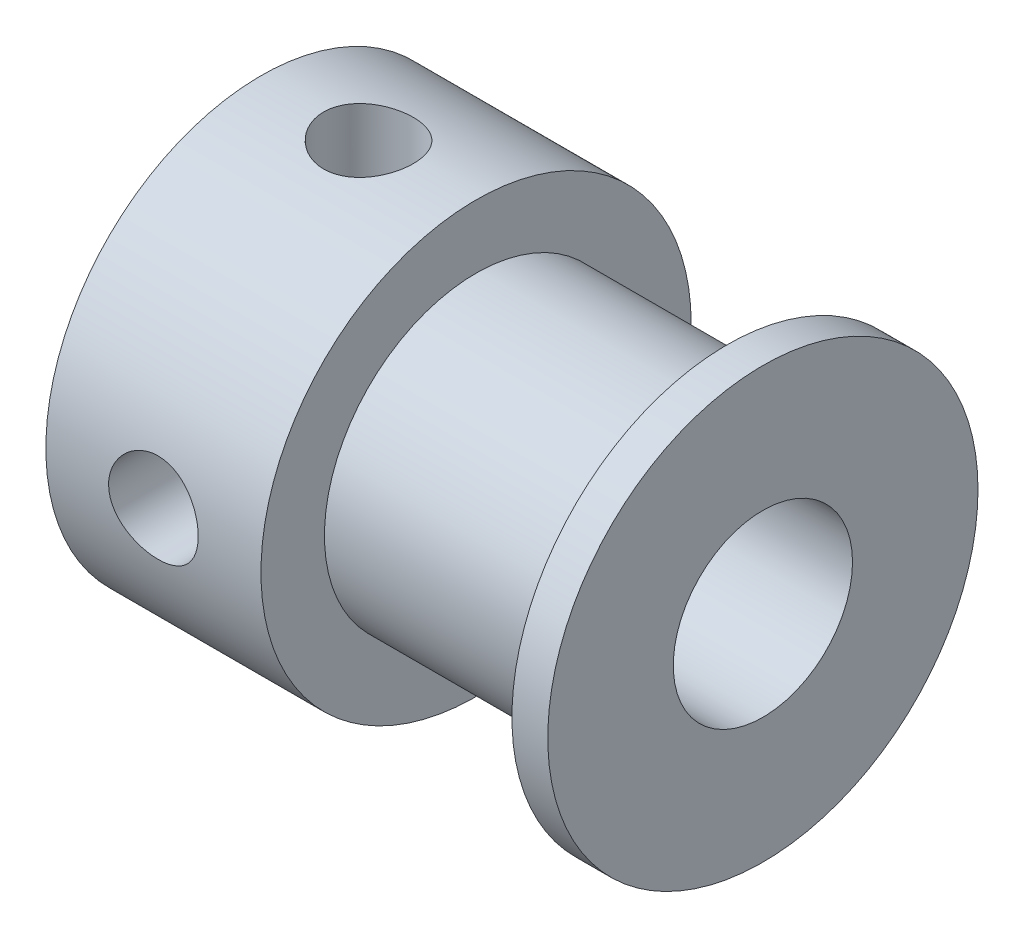
ISO-10303-21;
HEADER;
FILE_DESCRIPTION(('STEP AP214'),'2;1');
FILE_NAME('part.step','',(''),(''),'','','');
FILE_SCHEMA(('AUTOMOTIVE_DESIGN { 1 0 10303 214 1 1 1 1 }'));
ENDSEC;
DATA;
#1=APPLICATION_CONTEXT('core data for automotive mechanical design processes');
#2=APPLICATION_PROTOCOL_DEFINITION('international standard','automotive_design',2000,#1);
#3=PRODUCT_CONTEXT('',#1,'mechanical');
#4=PRODUCT('Part','Part','',(#3));
#5=PRODUCT_RELATED_PRODUCT_CATEGORY('part','',(#4));
#6=PRODUCT_DEFINITION_FORMATION('','',#4);
#7=PRODUCT_DEFINITION_CONTEXT('part definition',#1,'design');
#8=PRODUCT_DEFINITION('design','',#6,#7);
#9=PRODUCT_DEFINITION_SHAPE('','',#8);
#10=(LENGTH_UNIT() NAMED_UNIT(*) SI_UNIT(.MILLI.,.METRE.));
#11=(NAMED_UNIT(*) PLANE_ANGLE_UNIT() SI_UNIT($,.RADIAN.));
#12=(NAMED_UNIT(*) SI_UNIT($,.STERADIAN.) SOLID_ANGLE_UNIT());
#13=UNCERTAINTY_MEASURE_WITH_UNIT(LENGTH_MEASURE(1.E-05),#10,'distance_accuracy_value','');
#14=(GEOMETRIC_REPRESENTATION_CONTEXT(3) GLOBAL_UNCERTAINTY_ASSIGNED_CONTEXT((#13)) GLOBAL_UNIT_ASSIGNED_CONTEXT((#10,
#11,#12)) REPRESENTATION_CONTEXT('',''));
#15=CARTESIAN_POINT('',(0.,0.,0.));
#16=DIRECTION('',(0.,0.,1.));
#17=DIRECTION('',(1.,0.,0.));
#18=AXIS2_PLACEMENT_3D('',#15,#16,#17);
#19=CARTESIAN_POINT('',(0.,0.,0.));
#20=DIRECTION('',(1.,0.,0.));
#21=DIRECTION('',(0.,0.,-1.));
#22=AXIS2_PLACEMENT_3D('',#19,#20,#21);
#23=CYLINDRICAL_SURFACE('',#22,2.5);
#24=CARTESIAN_POINT('',(1.75000000000001,0.,2.5));
#25=CARTESIAN_POINT('',(1.75000412789938,0.0657149536912327,2.49999641755189));
#26=CARTESIAN_POINT('',(1.7552125914021,0.13150824962254,2.49738113774397));
#27=CARTESIAN_POINT('',(1.77581610042615,0.26115029408553,2.48717695046745));
#28=CARTESIAN_POINT('',(1.79123049124707,0.324995108391878,2.4795785978623));
#29=CARTESIAN_POINT('',(1.831492260771,0.448666931100716,2.4602034925414));
#30=CARTESIAN_POINT('',(1.85630298031002,0.508508503673972,2.448442989719));
#31=CARTESIAN_POINT('',(1.91446327670618,0.623090771008203,2.42182220644723));
#32=CARTESIAN_POINT('',(1.94781218031107,0.677831867487559,2.40696217041913));
#33=CARTESIAN_POINT('',(2.02439656185663,0.784384772202394,2.37445322822571));
#34=CARTESIAN_POINT('',(2.06810809904956,0.835819013902635,2.3566899890942));
#35=CARTESIAN_POINT('',(2.1631518490588,0.930974306083716,2.32074962808431));
#36=CARTESIAN_POINT('',(2.21448981471555,0.974689478883452,2.30257220261294));
#37=CARTESIAN_POINT('',(2.32810418690423,1.05656500056284,2.26623688996684));
#38=CARTESIAN_POINT('',(2.39092012293239,1.09403166943954,2.24818983712665));
#39=CARTESIAN_POINT('',(2.52295916998277,1.15771028361336,2.21607473465401));
#40=CARTESIAN_POINT('',(2.59217766090344,1.18393026870791,2.20200384508737));
#41=CARTESIAN_POINT('',(2.73083138177741,1.22266555273573,2.18072333797261));
#42=CARTESIAN_POINT('',(2.80000556508424,1.23590732135054,2.17315339479642));
#43=CARTESIAN_POINT('',(2.93997354722435,1.25053374163605,2.1647736243566));
#44=CARTESIAN_POINT('',(3.01076567608894,1.25193011046634,2.16395711679111));
#45=CARTESIAN_POINT('',(3.14285753039421,1.24335910896536,2.16888662821561));
#46=CARTESIAN_POINT('',(3.20428003902881,1.23473069942102,2.17385954577517));
#47=CARTESIAN_POINT('',(3.3246523867163,1.20867481132116,2.18845285917313));
#48=CARTESIAN_POINT('',(3.38360143163164,1.19124452987206,2.19807473539721));
#49=CARTESIAN_POINT('',(3.49903641570707,1.1477622254825,2.22109345515927));
#50=CARTESIAN_POINT('',(3.55543299848223,1.12151883389499,2.23457300829999));
#51=CARTESIAN_POINT('',(3.66329286573751,1.061302109585,2.26379255351755));
#52=CARTESIAN_POINT('',(3.71475391950011,1.02732530476558,2.27953355975239));
#53=CARTESIAN_POINT('',(3.81815156592903,0.94758256864098,2.31391447379108));
#54=CARTESIAN_POINT('',(3.86932109197019,0.900868072961596,2.33266887795933));
#55=CARTESIAN_POINT('',(3.96341927323862,0.799444473426712,2.36934529125509));
#56=CARTESIAN_POINT('',(4.00634399004235,0.744731570717852,2.38726689948501));
#57=CARTESIAN_POINT('',(4.08460707628715,0.625645632289807,2.42127484103705));
#58=CARTESIAN_POINT('',(4.11950059055717,0.560941989499257,2.43723730202509));
#59=CARTESIAN_POINT('',(4.17762128630375,0.425582769360993,2.46447351401553));
#60=CARTESIAN_POINT('',(4.20085773126895,0.354931970331593,2.47575098679441));
#61=CARTESIAN_POINT('',(4.23309425464584,0.215958114575875,2.49155417176795));
#62=CARTESIAN_POINT('',(4.24311404468347,0.147926913185404,2.4965617287664));
#63=CARTESIAN_POINT('',(4.2518309139181,0.0109744999366913,2.50091266823877));
#64=CARTESIAN_POINT('',(4.25053335704934,-0.057946274837377,2.5002587340164));
#65=CARTESIAN_POINT('',(4.23724163947655,-0.189041214982492,2.49363990316801));
#66=CARTESIAN_POINT('',(4.22608433408745,-0.251324260062442,2.48809057110237));
#67=CARTESIAN_POINT('',(4.19470241013114,-0.373008615377395,2.47277714143524));
#68=CARTESIAN_POINT('',(4.1744767919333,-0.432409607113745,2.46301257917916));
#69=CARTESIAN_POINT('',(4.12500191695853,-0.548610760562079,2.43980314267087));
#70=CARTESIAN_POINT('',(4.09551118735398,-0.605287996257689,2.42626102212424));
#71=CARTESIAN_POINT('',(4.02861558044244,-0.713076702123648,2.39679967896386));
#72=CARTESIAN_POINT('',(3.9912073317582,-0.764185787219099,2.38087944457232));
#73=CARTESIAN_POINT('',(3.9052994683339,-0.864709611613313,2.34635276671831));
#74=CARTESIAN_POINT('',(3.85607141443304,-0.913465097280795,2.32763606060552));
#75=CARTESIAN_POINT('',(3.75009356091336,-1.00232040139154,2.29077989504843));
#76=CARTESIAN_POINT('',(3.69333860147953,-1.04241423211355,2.27264084226908));
#77=CARTESIAN_POINT('',(3.57044543224961,-1.11463489312211,2.23813990282585));
#78=CARTESIAN_POINT('',(3.50398591723925,-1.14628186984829,2.2219066207934));
#79=CARTESIAN_POINT('',(3.36561241538434,-1.19760353251725,2.19467590460158));
#80=CARTESIAN_POINT('',(3.29370559187351,-1.21729364485946,2.18367172800773));
#81=CARTESIAN_POINT('',(3.15386222142319,-1.24232710931209,2.16951876260834));
#82=CARTESIAN_POINT('',(3.0862071832137,-1.24886624550107,2.16571729325614));
#83=CARTESIAN_POINT('',(2.95069116603659,-1.25086144297598,2.16456693307719));
#84=CARTESIAN_POINT('',(2.88283028907571,-1.24632230828049,2.16721524534441));
#85=CARTESIAN_POINT('',(2.75564562308498,-1.22740765699032,2.17797327562531));
#86=CARTESIAN_POINT('',(2.6961244123195,-1.21401039292849,2.18553868102992));
#87=CARTESIAN_POINT('',(2.58023985071912,-1.1789691977808,2.20463770234897));
#88=CARTESIAN_POINT('',(2.52387752238504,-1.15732261394975,2.21617259462095));
#89=CARTESIAN_POINT('',(2.41171893626674,-1.10476968162585,2.2428566295566));
#90=CARTESIAN_POINT('',(2.35621512271288,-1.07333892227057,2.25819652995239));
#91=CARTESIAN_POINT('',(2.25090682977427,-1.00268871454579,2.29044164543238));
#92=CARTESIAN_POINT('',(2.20110533685189,-0.963465214048303,2.30734767243153));
#93=CARTESIAN_POINT('',(2.10232252205298,-0.872754158330795,2.34327903949142));
#94=CARTESIAN_POINT('',(2.0541761220476,-0.820355528762707,2.36231229139336));
#95=CARTESIAN_POINT('',(1.96717127072046,-0.707693507775343,2.3984719031886));
#96=CARTESIAN_POINT('',(1.92831782571714,-0.647425904070975,2.4155972326005));
#97=CARTESIAN_POINT('',(1.86095454654725,-0.519914496024928,2.44622511981379));
#98=CARTESIAN_POINT('',(1.83251978823571,-0.452624379918263,2.45970120703636));
#99=CARTESIAN_POINT('',(1.78773979010132,-0.313427626617735,2.48126676704332));
#100=CARTESIAN_POINT('',(1.77136019146303,-0.241534749528953,2.48937154216165));
#101=CARTESIAN_POINT('',(1.7576282361552,-0.140752433104227,2.49619327387079));
#102=CARTESIAN_POINT('',(1.75477169892048,-0.112702349299371,2.49761706674002));
#103=CARTESIAN_POINT('',(1.750956668104,-0.0564396647589458,2.49952121222331));
#104=CARTESIAN_POINT('',(1.74999822691101,-0.0282270595592261,2.50000153879704));
#105=CARTESIAN_POINT('',(1.75000000000001,0.,2.5));
#106=B_SPLINE_CURVE_WITH_KNOTS('',3,(#24,#25,#26,#27,#28,#29,#30,#31,#32,#33,#34,#35,#36,#37,
#38,#39,#40,#41,#42,#43,#44,#45,#46,#47,#48,#49,#50,#51,#52,#53,#54,#55,#56,#57,#58,#59,#60,#61,
#62,#63,#64,#65,#66,#67,#68,#69,#70,#71,#72,#73,#74,#75,#76,#77,#78,#79,#80,#81,#82,#83,#84,#85,
#86,#87,#88,#89,#90,#91,#92,#93,#94,#95,#96,#97,#98,#99,#100,#101,#102,#103,#104,#105),
.UNSPECIFIED.,.T.,.F.,(4,2,2,2,2,2,2,2,2,2,2,2,2,2,2,2,2,2,2,2,2,2,2,2,2,2,2,2,2,2,2,2,2,2,2,2,
2,2,2,2,4),(0.,0.197030321775364,0.394435187136495,0.59107769436537,0.787704700726955,
0.996227198397605,1.20490779706754,1.4297715803844,1.6544743487285,1.86572515175286,
2.07676696661274,2.26257140511649,2.44843504907097,2.63862800210608,2.82890651575276,
3.04331176667346,3.25781918248356,3.48228777768049,3.70657771140347,3.9122911308918,
4.11790705639343,4.3075863313265,4.49728652038662,4.69241070034871,4.88761813435421,
5.10199513305521,5.31651985769287,5.54143352699589,5.76605639925969,5.96911634372963,
6.17208824825003,6.35572412805225,6.53941910979594,6.73545570969514,6.93159451423693,
7.15156553440619,7.37165479220712,7.59330017078652,7.81431135781158,7.89894100172117,
7.98357298143554),.UNSPECIFIED.);
#107=CARTESIAN_POINT('',(1.75000000000001,0.,2.5));
#108=VERTEX_POINT('',#107);
#109=EDGE_CURVE('E80',#108,#108,#106,.T.);
#110=ORIENTED_EDGE('',*,*,#109,.F.);
#111=EDGE_LOOP('',(#110));
#112=FACE_BOUND('',#111,.T.);
#113=CARTESIAN_POINT('',(3.,2.1650635094611,-1.25));
#114=CARTESIAN_POINT('',(3.06513476024406,2.16506918410574,-1.24999545384316));
#115=CARTESIAN_POINT('',(3.13035176440631,2.16804751484696,-1.24487496341652));
#116=CARTESIAN_POINT('',(3.25878408084644,2.17952958065066,-1.22465401237257));
#117=CARTESIAN_POINT('',(3.32199489380426,2.18804492569449,-1.20953258069272));
#118=CARTESIAN_POINT('',(3.44431458042993,2.20936683256748,-1.17012493587476));
#119=CARTESIAN_POINT('',(3.50344331559198,2.22215054341565,-1.14588744061716));
#120=CARTESIAN_POINT('',(3.6167802524959,2.25053331021072,-1.08908440672046));
#121=CARTESIAN_POINT('',(3.67098818782807,2.26613251845081,-1.05651841754472));
#122=CARTESIAN_POINT('',(3.77788216069688,2.29996086321802,-0.980833175663598));
#123=CARTESIAN_POINT('',(3.83007391959193,2.31830079547442,-0.937065045179713));
#124=CARTESIAN_POINT('',(3.92676048550839,2.35464978482132,-0.841567259518085));
#125=CARTESIAN_POINT('',(3.9712514532294,2.37265867289062,-0.789833657227866));
#126=CARTESIAN_POINT('',(4.05420893893458,2.40776846191186,-0.675611954268182));
#127=CARTESIAN_POINT('',(4.09206720982441,2.42472633022716,-0.612633986265718));
#128=CARTESIAN_POINT('',(4.1564260665572,2.45438445124411,-0.48019628324938));
#129=CARTESIAN_POINT('',(4.18293382017146,2.46708738979677,-0.410740672672694));
#130=CARTESIAN_POINT('',(4.22188082662637,2.48600576555297,-0.272556179907471));
#131=CARTESIAN_POINT('',(4.23518690794442,2.49261850276115,-0.204127238111022));
#132=CARTESIAN_POINT('',(4.2502076483438,2.50009479807584,-0.0657132858723104));
#133=CARTESIAN_POINT('',(4.25192932099464,2.50096183480737,0.00427075730467264));
#134=CARTESIAN_POINT('',(4.24406665753706,2.49703727395563,0.137290655529687));
#135=CARTESIAN_POINT('',(4.23545248059847,2.49273119865201,0.200401498970989));
#136=CARTESIAN_POINT('',(4.20889894511918,2.47967806574684,0.324142214897902));
#137=CARTESIAN_POINT('',(4.19095888877972,2.47093067582992,0.384771901367406));
#138=CARTESIAN_POINT('',(4.14614679238773,2.44964479109568,0.502886739461942));
#139=CARTESIAN_POINT('',(4.11915460853491,2.43705551911499,0.560316779393972));
#140=CARTESIAN_POINT('',(4.05717072974813,2.40922057483359,0.66997100189166));
#141=CARTESIAN_POINT('',(4.02217617087206,2.39397395196855,0.722193311048307));
#142=CARTESIAN_POINT('',(3.94138081058373,2.36055492999037,0.825217076122743));
#143=CARTESIAN_POINT('',(3.89487121459249,2.34224219997719,0.8754175937867));
#144=CARTESIAN_POINT('',(3.79426284383728,2.30567925733515,0.967630462872225));
#145=CARTESIAN_POINT('',(3.74015828465742,2.28742910332036,1.00963651446779));
#146=CARTESIAN_POINT('',(3.62168975946989,2.25180195115606,1.08688166830276));
#147=CARTESIAN_POINT('',(3.55689247118223,2.23455399988385,1.12152164372256));
#148=CARTESIAN_POINT('',(3.42132791080125,2.2046931284822,1.17914889125154));
#149=CARTESIAN_POINT('',(3.35056695872805,2.19207537557584,1.20214832276361));
#150=CARTESIAN_POINT('',(3.21098186089651,2.17430794771293,1.2339752637813));
#151=CARTESIAN_POINT('',(3.14244860119556,2.16864569810621,1.24378140264997));
#152=CARTESIAN_POINT('',(3.00449832310432,2.16397399202012,1.25189618326428));
#153=CARTESIAN_POINT('',(2.93508196360027,2.1649598361164,1.25021294664378));
#154=CARTESIAN_POINT('',(2.80543260177659,2.17292920675731,1.23629505417996));
#155=CARTESIAN_POINT('',(2.74502568611509,2.17924484383318,1.22523477089058));
#156=CARTESIAN_POINT('',(2.6270402671613,2.19617526939176,1.19462035579055));
#157=CARTESIAN_POINT('',(2.56946268656674,2.20679145006292,1.17506347327952));
#158=CARTESIAN_POINT('',(2.45573583637163,2.23170277599571,1.12705948575611));
#159=CARTESIAN_POINT('',(2.39977622893306,2.24614554053829,1.0982425796159));
#160=CARTESIAN_POINT('',(2.29316341057626,2.27695149371562,1.03285883001975));
#161=CARTESIAN_POINT('',(2.2425129456084,2.29331566693935,0.99628800541527));
#162=CARTESIAN_POINT('',(2.14127654059557,2.3285999807042,0.911046458998566));
#163=CARTESIAN_POINT('',(2.09150356160293,2.34758228942861,0.861431590393708));
#164=CARTESIAN_POINT('',(2.00073470250801,2.38417793722366,0.75425561924786));
#165=CARTESIAN_POINT('',(1.95974178721183,2.40179081259637,0.696691843319183));
#166=CARTESIAN_POINT('',(1.88678284256237,2.43426702113696,0.573169203198446));
#167=CARTESIAN_POINT('',(1.85508360223636,2.44904552090037,0.507028871967641));
#168=CARTESIAN_POINT('',(1.80357762017826,2.47354193699126,0.369402955801352));
#169=CARTESIAN_POINT('',(1.78376043579212,2.48326429595466,0.29792212674022));
#170=CARTESIAN_POINT('',(1.75828929478167,2.49584385227353,0.158724602913021));
#171=CARTESIAN_POINT('',(1.75150265515486,2.49924909885239,0.0912643048130715));
#172=CARTESIAN_POINT('',(1.748945918182,2.50052662968914,-0.0439074824390041));
#173=CARTESIAN_POINT('',(1.75317196434555,2.49840085083612,-0.111618875368858));
#174=CARTESIAN_POINT('',(1.77177050849453,2.48917461047403,-0.240672490396433));
#175=CARTESIAN_POINT('',(1.78545606157209,2.48241118334987,-0.302140397264079));
#176=CARTESIAN_POINT('',(1.82165874912871,2.46490117079279,-0.421807440229521));
#177=CARTESIAN_POINT('',(1.84417715011682,2.45415401415995,-0.480006106194385));
#178=CARTESIAN_POINT('',(1.89840881520747,2.4290741343515,-0.594279257806105));
#179=CARTESIAN_POINT('',(1.9304741540098,2.41460771498499,-0.650156428375057));
#180=CARTESIAN_POINT('',(2.00244741357381,2.38360166427283,-0.75596830226753));
#181=CARTESIAN_POINT('',(2.04235893639459,2.36706108197951,-0.805900259268633));
#182=CARTESIAN_POINT('',(2.13349642377838,2.33160762783285,-0.903642505196113));
#183=CARTESIAN_POINT('',(2.18545310934649,2.31262248764622,-0.950747105674089));
#184=CARTESIAN_POINT('',(2.29681340141221,2.27578845203566,-1.03582910924334));
#185=CARTESIAN_POINT('',(2.35622352608461,2.25794057202332,-1.07379843751257));
#186=CARTESIAN_POINT('',(2.48329580822619,2.22499506631145,-1.14053884973207));
#187=CARTESIAN_POINT('',(2.55115941391092,2.21000217820338,-1.16898133245117));
#188=CARTESIAN_POINT('',(2.69166550542472,2.1858269541044,-1.21359838688301));
#189=CARTESIAN_POINT('',(2.76429111114086,2.17662520184628,-1.22981398896918));
#190=CARTESIAN_POINT('',(2.864756694565,2.16911590752238,-1.24295875983052));
#191=CARTESIAN_POINT('',(2.89170986799735,2.1676016125644,-1.24559513120481));
#192=CARTESIAN_POINT('',(2.9457706008528,2.16557419859688,-1.24911675636245));
#193=CARTESIAN_POINT('',(2.97287817048234,2.16506114656387,-1.25000189299984));
#194=CARTESIAN_POINT('',(3.,2.1650635094611,-1.25));
#195=B_SPLINE_CURVE_WITH_KNOTS('',3,(#113,#114,#115,#116,#117,#118,#119,#120,#121,#122,#123,
#124,#125,#126,#127,#128,#129,#130,#131,#132,#133,#134,#135,#136,#137,#138,#139,#140,#141,#142,
#143,#144,#145,#146,#147,#148,#149,#150,#151,#152,#153,#154,#155,#156,#157,#158,#159,#160,#161,
#162,#163,#164,#165,#166,#167,#168,#169,#170,#171,#172,#173,#174,#175,#176,#177,#178,#179,#180,
#181,#182,#183,#184,#185,#186,#187,#188,#189,#190,#191,#192,#193,#194),.UNSPECIFIED.,.T.,.F.,(4,
2,2,2,2,2,2,2,2,2,2,2,2,2,2,2,2,2,2,2,2,2,2,2,2,2,2,2,2,2,2,2,2,2,2,2,2,2,2,2,4),(0.,
0.195290153243394,0.390991116031005,0.585660744898606,0.780340906806436,0.99107789062279,
1.20191963855464,1.42697365298454,1.65188533704864,1.86079356209919,2.0695752960755,
2.26020121855673,2.45084140646819,2.64411918413933,2.8374662418784,3.04908989321113,
3.26087560307398,3.4861105216181,3.71110967764631,3.91827863567764,4.12530116485466,
4.30967729280032,4.49411315545078,4.68709120507609,4.88016857775059,5.09758429475766,
5.31507331222752,5.53830226766207,5.76133474760964,5.96390337986858,6.16640108492464,
6.35555531089365,6.54473666890016,6.74200938399339,6.93937287625898,7.15637802312584,
7.37357428556442,7.59763436298256,7.8209391625345,7.90225168981636,7.98356965618175),.UNSPECIFIED.);
#196=CARTESIAN_POINT('',(3.,2.1650635094611,-1.25));
#197=VERTEX_POINT('',#196);
#198=EDGE_CURVE('E73',#197,#197,#195,.T.);
#199=ORIENTED_EDGE('',*,*,#198,.F.);
#200=EDGE_LOOP('',(#199));
#201=FACE_BOUND('',#200,.T.);
#202=CARTESIAN_POINT('',(14.,0.,0.));
#203=DIRECTION('',(1.,0.,0.));
#204=DIRECTION('',(0.,0.,-1.));
#205=AXIS2_PLACEMENT_3D('',#202,#203,#204);
#206=CIRCLE('',#205,2.5);
#207=CARTESIAN_POINT('',(14.,0.,-2.5));
#208=VERTEX_POINT('',#207);
#209=EDGE_CURVE('E79',#208,#208,#206,.T.);
#210=ORIENTED_EDGE('',*,*,#209,.T.);
#211=EDGE_LOOP('',(#210));
#212=FACE_BOUND('',#211,.T.);
#213=CARTESIAN_POINT('',(0.,0.,0.));
#214=DIRECTION('',(1.,0.,0.));
#215=DIRECTION('',(0.,0.,-1.));
#216=AXIS2_PLACEMENT_3D('',#213,#214,#215);
#217=CIRCLE('',#216,2.5);
#218=CARTESIAN_POINT('',(0.,0.,-2.5));
#219=VERTEX_POINT('',#218);
#220=EDGE_CURVE('E49',#219,#219,#217,.T.);
#221=ORIENTED_EDGE('',*,*,#220,.F.);
#222=EDGE_LOOP('',(#221));
#223=FACE_BOUND('',#222,.T.);
#224=ADVANCED_FACE('F34',(#112,#201,#212,#223),#23,.F.);
#225=CARTESIAN_POINT('',(0.,2.5,0.));
#226=DIRECTION('',(-1.,0.,0.));
#227=DIRECTION('',(0.,0.,1.));
#228=AXIS2_PLACEMENT_3D('',#225,#226,#227);
#229=PLANE('',#228);
#230=ORIENTED_EDGE('',*,*,#220,.T.);
#231=EDGE_LOOP('',(#230));
#232=FACE_BOUND('',#231,.T.);
#233=CARTESIAN_POINT('',(0.,0.,0.));
#234=DIRECTION('',(1.,0.,0.));
#235=DIRECTION('',(0.,0.,-1.));
#236=AXIS2_PLACEMENT_3D('',#233,#234,#235);
#237=CIRCLE('',#236,6.);
#238=CARTESIAN_POINT('',(0.,0.,-6.));
#239=VERTEX_POINT('',#238);
#240=EDGE_CURVE('E53',#239,#239,#237,.T.);
#241=ORIENTED_EDGE('',*,*,#240,.F.);
#242=EDGE_LOOP('',(#241));
#243=FACE_BOUND('',#242,.T.);
#244=ADVANCED_FACE('F104',(#232,#243),#229,.T.);
#245=CARTESIAN_POINT('',(0.,0.,0.));
#246=DIRECTION('',(1.,0.,0.));
#247=DIRECTION('',(0.,0.,-1.));
#248=AXIS2_PLACEMENT_3D('',#245,#246,#247);
#249=CYLINDRICAL_SURFACE('',#248,6.);
#250=CARTESIAN_POINT('',(1.75000000000001,0.,6.));
#251=CARTESIAN_POINT('',(1.75000247746923,-0.0694090417016603,5.99999871526651));
#252=CARTESIAN_POINT('',(1.75580066571876,-0.138848789520875,5.99878328775043));
#253=CARTESIAN_POINT('',(1.77881934953286,-0.275761316266992,5.99405200990679));
#254=CARTESIAN_POINT('',(1.79604852303694,-0.343232560128311,5.99053441189248));
#255=CARTESIAN_POINT('',(1.84137045492183,-0.474209132291339,5.98159109196202));
#256=CARTESIAN_POINT('',(1.86945239599889,-0.537718336709182,5.97616727052645));
#257=CARTESIAN_POINT('',(1.93564960885619,-0.659120328605954,5.96399927809859));
#258=CARTESIAN_POINT('',(1.97376443115584,-0.717013367534323,5.95725516625975));
#259=CARTESIAN_POINT('',(2.05953634019065,-0.826390324308832,5.9430770002465));
#260=CARTESIAN_POINT('',(2.10731200123509,-0.87778024416268,5.93563505848531));
#261=CARTESIAN_POINT('',(2.21079465919511,-0.971877776769387,5.92095657692448));
#262=CARTESIAN_POINT('',(2.26650231187227,-1.01458467096098,5.91372005416683));
#263=CARTESIAN_POINT('',(2.38495196876616,-1.09051031677216,5.90019442595308));
#264=CARTESIAN_POINT('',(2.44775838450275,-1.1236305468065,5.89391545174828));
#265=CARTESIAN_POINT('',(2.57819745177276,-1.17881119348063,5.8831284065002));
#266=CARTESIAN_POINT('',(2.64582958244254,-1.20087280167641,5.87862014467568));
#267=CARTESIAN_POINT('',(2.78298523741564,-1.23300240133736,5.87196500986123));
#268=CARTESIAN_POINT('',(2.85246835933477,-1.24323597696798,5.86978556855865));
#269=CARTESIAN_POINT('',(2.99219684286263,-1.25193357655614,5.86793690716491));
#270=CARTESIAN_POINT('',(3.0624421188653,-1.25039890894686,5.86826740800981));
#271=CARTESIAN_POINT('',(3.20048102797518,-1.23573719037196,5.87137174319175));
#272=CARTESIAN_POINT('',(3.26829597966121,-1.2228010523272,5.87410533679901));
#273=CARTESIAN_POINT('',(3.40077150964492,-1.18600543529945,5.88164437615942));
#274=CARTESIAN_POINT('',(3.46543192560633,-1.16214539481381,5.88644992841317));
#275=CARTESIAN_POINT('',(3.59030722841598,-1.10400003213928,5.89763191464102));
#276=CARTESIAN_POINT('',(3.65048629652707,-1.06964002534236,5.90401953785586));
#277=CARTESIAN_POINT('',(3.76429574426816,-0.991522699274812,5.91763890010721));
#278=CARTESIAN_POINT('',(3.81792530883597,-0.947764212262582,5.92487074398537));
#279=CARTESIAN_POINT('',(3.91821396108037,-0.851074921546778,5.93953730929909));
#280=CARTESIAN_POINT('',(3.96471616889701,-0.797981433412078,5.94697323199473));
#281=CARTESIAN_POINT('',(4.04818044222897,-0.684667288611794,5.96108088143001));
#282=CARTESIAN_POINT('',(4.08514236459839,-0.624446525025762,5.96775259670236));
#283=CARTESIAN_POINT('',(4.14851008153595,-0.498405541235476,5.97959870942815));
#284=CARTESIAN_POINT('',(4.17489680456711,-0.432575461926497,5.98477039710258));
#285=CARTESIAN_POINT('',(4.21619170483549,-0.297284620972153,5.99301338211281));
#286=CARTESIAN_POINT('',(4.23110139323139,-0.227824338595088,5.99608495596053));
#287=CARTESIAN_POINT('',(4.24879425206788,-0.0885918657008341,5.99974275215455));
#288=CARTESIAN_POINT('',(4.25179194149424,-0.018848055526178,6.00037293537579));
#289=CARTESIAN_POINT('',(4.24615505003089,0.120143798757714,5.99919952252774));
#290=CARTESIAN_POINT('',(4.2375211813984,0.189391872962257,5.99739607548153));
#291=CARTESIAN_POINT('',(4.20904434653046,0.324726367119812,5.99158564979184));
#292=CARTESIAN_POINT('',(4.18931251461653,0.390837192894204,5.98760052868077));
#293=CARTESIAN_POINT('',(4.13932213957859,0.518811446661329,5.97787227242395));
#294=CARTESIAN_POINT('',(4.10906275913401,0.580674536336772,5.97212899744579));
#295=CARTESIAN_POINT('',(4.03841962176243,0.699294306943491,5.95941241490714));
#296=CARTESIAN_POINT('',(3.99790807043093,0.755973219469831,5.9524239381233));
#297=CARTESIAN_POINT('',(3.90808043692372,0.861805445886516,5.93802568299709));
#298=CARTESIAN_POINT('',(3.85876332448105,0.910957877913282,5.93061585542511));
#299=CARTESIAN_POINT('',(3.7517444230003,1.0011786486518,5.91606024531377));
#300=CARTESIAN_POINT('',(3.69391696804471,1.04209914600204,5.90892089307501));
#301=CARTESIAN_POINT('',(3.57208371578621,1.11364719079243,5.89585601015805));
#302=CARTESIAN_POINT('',(3.50807817586089,1.14427516677863,5.88993042894651));
#303=CARTESIAN_POINT('',(3.37603880370177,1.19417246443921,5.88001700708041));
#304=CARTESIAN_POINT('',(3.30802896283416,1.21350309828031,5.87601872784687));
#305=CARTESIAN_POINT('',(3.16963344950774,1.24044038523407,5.87039184709697));
#306=CARTESIAN_POINT('',(3.09924811838056,1.2480487154444,5.86876290660367));
#307=CARTESIAN_POINT('',(2.95958659900035,1.25125926487611,5.86807907308506));
#308=CARTESIAN_POINT('',(2.89031592977795,1.24709542622725,5.86897402321502));
#309=CARTESIAN_POINT('',(2.75348599107978,1.22739905314031,5.87312447254928));
#310=CARTESIAN_POINT('',(2.6859267051839,1.21186662782265,5.87637994909626));
#311=CARTESIAN_POINT('',(2.55460222810934,1.16998217768584,5.88486132447716));
#312=CARTESIAN_POINT('',(2.49082675351308,1.14366117568421,5.8900815700793));
#313=CARTESIAN_POINT('',(2.36856122397334,1.08097457299757,5.90190705738738));
#314=CARTESIAN_POINT('',(2.31007166036688,1.04460803983029,5.9085124276546));
#315=CARTESIAN_POINT('',(2.19887837292056,0.962073695342405,5.92251579551146));
#316=CARTESIAN_POINT('',(2.14630087543502,0.915737890418221,5.92992613868404));
#317=CARTESIAN_POINT('',(2.04959050677365,0.81492443811533,5.94461839583213));
#318=CARTESIAN_POINT('',(2.00545958244852,0.760444918832964,5.9519002798488));
#319=CARTESIAN_POINT('',(1.92641142681595,0.644134427507699,5.96561444547637));
#320=CARTESIAN_POINT('',(1.89160632011372,0.582225921521345,5.97203596073244));
#321=CARTESIAN_POINT('',(1.83294977156998,0.453319843998451,5.98319908494092));
#322=CARTESIAN_POINT('',(1.80908875281813,0.386326781907242,5.98794216182101));
#323=CARTESIAN_POINT('',(1.77745972171158,0.266015292900104,5.99432499781443));
#324=CARTESIAN_POINT('',(1.76718123679115,0.213367593727928,5.99644035661395));
#325=CARTESIAN_POINT('',(1.75345054572268,0.107152674176536,5.99927832789758));
#326=CARTESIAN_POINT('',(1.74999808733281,0.0535854878488716,6.00000099184586));
#327=CARTESIAN_POINT('',(1.75000000000001,0.,6.));
#328=B_SPLINE_CURVE_WITH_KNOTS('',3,(#250,#251,#252,#253,#254,#255,#256,#257,#258,#259,#260,
#261,#262,#263,#264,#265,#266,#267,#268,#269,#270,#271,#272,#273,#274,#275,#276,#277,#278,#279,
#280,#281,#282,#283,#284,#285,#286,#287,#288,#289,#290,#291,#292,#293,#294,#295,#296,#297,#298,
#299,#300,#301,#302,#303,#304,#305,#306,#307,#308,#309,#310,#311,#312,#313,#314,#315,#316,#317,
#318,#319,#320,#321,#322,#323,#324,#325,#326,#327),.UNSPECIFIED.,.T.,.F.,(4,2,2,2,2,2,2,2,2,2,2,
2,2,2,2,2,2,2,2,2,2,2,2,2,2,2,2,2,2,2,2,2,2,2,2,2,2,2,4),(0.,0.208031045103182,
0.416220199906223,0.624202378825439,0.832175241572985,1.04287526388122,1.25359271551785,
1.46640449178548,1.67919333285489,1.88896575169853,2.09871484767163,2.30501712129058,
2.51133000030278,2.71914592416748,2.92698768368033,3.13889526355464,3.35080602278216,
3.56309724499661,3.77536051045769,3.98378339407673,4.19219351552275,4.39855286632619,
4.60492863390931,4.81401583995734,5.02312752564571,5.23571263829333,5.44828889851306,
5.65970050095022,5.87108185414182,6.07829223291035,6.28550062281358,6.49211731393252,
6.69875319081476,6.90919024830305,7.11967575117366,7.33258864398252,7.54531486464969,
7.70592588477276,7.86653096973387),.UNSPECIFIED.);
#329=CARTESIAN_POINT('',(1.75000000000001,0.,6.));
#330=VERTEX_POINT('',#329);
#331=EDGE_CURVE('E10',#330,#330,#328,.T.);
#332=ORIENTED_EDGE('',*,*,#331,.F.);
#333=EDGE_LOOP('',(#332));
#334=FACE_BOUND('',#333,.T.);
#335=CARTESIAN_POINT('',(4.25,6.,0.));
#336=CARTESIAN_POINT('',(4.24999752253078,5.99999871526651,-0.0694090417016606));
#337=CARTESIAN_POINT('',(4.24419933428125,5.99878328775043,-0.138848789520875));
#338=CARTESIAN_POINT('',(4.22118065046715,5.99405200990679,-0.275761316266993));
#339=CARTESIAN_POINT('',(4.20395147696307,5.99053441189248,-0.343232560128312));
#340=CARTESIAN_POINT('',(4.15862954507818,5.98159109196202,-0.474209132291342));
#341=CARTESIAN_POINT('',(4.13054760400111,5.97616727052645,-0.537718336709185));
#342=CARTESIAN_POINT('',(4.06435039114382,5.96399927809859,-0.659120328605958));
#343=CARTESIAN_POINT('',(4.02623556884417,5.95725516625975,-0.717013367534327));
#344=CARTESIAN_POINT('',(3.94046365980936,5.9430770002465,-0.826390324308836));
#345=CARTESIAN_POINT('',(3.89268799876492,5.93563505848531,-0.877780244162685));
#346=CARTESIAN_POINT('',(3.78920534080489,5.92095657692448,-0.971877776769392));
#347=CARTESIAN_POINT('',(3.73349768812774,5.91372005416683,-1.01458467096099));
#348=CARTESIAN_POINT('',(3.61504803123384,5.90019442595308,-1.09051031677217));
#349=CARTESIAN_POINT('',(3.55224161549726,5.89391545174828,-1.12363054680651));
#350=CARTESIAN_POINT('',(3.42180254822724,5.8831284065002,-1.17881119348064));
#351=CARTESIAN_POINT('',(3.35417041755746,5.87862014467568,-1.20087280167641));
#352=CARTESIAN_POINT('',(3.21701476258436,5.87196500986122,-1.23300240133737));
#353=CARTESIAN_POINT('',(3.14753164066523,5.86978556855865,-1.24323597696799));
#354=CARTESIAN_POINT('',(3.00780315713737,5.86793690716491,-1.25193357655615));
#355=CARTESIAN_POINT('',(2.9375578811347,5.86826740800981,-1.25039890894687));
#356=CARTESIAN_POINT('',(2.79951897202482,5.87137174319175,-1.23573719037197));
#357=CARTESIAN_POINT('',(2.73170402033879,5.87410533679901,-1.2228010523272));
#358=CARTESIAN_POINT('',(2.59922849035507,5.88164437615942,-1.18600543529945));
#359=CARTESIAN_POINT('',(2.53456807439367,5.88644992841317,-1.16214539481382));
#360=CARTESIAN_POINT('',(2.40969277158402,5.89763191464102,-1.10400003213928));
#361=CARTESIAN_POINT('',(2.34951370347293,5.90401953785586,-1.06964002534237));
#362=CARTESIAN_POINT('',(2.23570425573184,5.91763890010721,-0.991522699274817));
#363=CARTESIAN_POINT('',(2.18207469116402,5.92487074398537,-0.947764212262587));
#364=CARTESIAN_POINT('',(2.08178603891963,5.93953730929909,-0.851074921546782));
#365=CARTESIAN_POINT('',(2.03528383110299,5.94697323199473,-0.797981433412082));
#366=CARTESIAN_POINT('',(1.95181955777103,5.96108088143001,-0.684667288611798));
#367=CARTESIAN_POINT('',(1.9148576354016,5.96775259670236,-0.624446525025765));
#368=CARTESIAN_POINT('',(1.85148991846405,5.97959870942815,-0.498405541235478));
#369=CARTESIAN_POINT('',(1.82510319543288,5.98477039710258,-0.432575461926499));
#370=CARTESIAN_POINT('',(1.78380829516451,5.99301338211281,-0.297284620972155));
#371=CARTESIAN_POINT('',(1.7688986067686,5.99608495596053,-0.227824338595089));
#372=CARTESIAN_POINT('',(1.75120574793212,5.99974275215455,-0.0885918657008347));
#373=CARTESIAN_POINT('',(1.74820805850575,6.00037293537579,-0.0188480555261782));
#374=CARTESIAN_POINT('',(1.7538449499691,5.99919952252774,0.120143798757715));
#375=CARTESIAN_POINT('',(1.7624788186016,5.99739607548153,0.189391872962258));
#376=CARTESIAN_POINT('',(1.79095565346953,5.99158564979184,0.324726367119814));
#377=CARTESIAN_POINT('',(1.81068748538347,5.98760052868077,0.390837192894206));
#378=CARTESIAN_POINT('',(1.86067786042141,5.97787227242395,0.518811446661331));
#379=CARTESIAN_POINT('',(1.89093724086598,5.97212899744579,0.580674536336775));
#380=CARTESIAN_POINT('',(1.96158037823756,5.95941241490714,0.699294306943494));
#381=CARTESIAN_POINT('',(2.00209192956906,5.9524239381233,0.755973219469834));
#382=CARTESIAN_POINT('',(2.09191956307627,5.93802568299709,0.86180544588652));
#383=CARTESIAN_POINT('',(2.14123667551894,5.93061585542511,0.910957877913286));
#384=CARTESIAN_POINT('',(2.2482555769997,5.91606024531377,1.0011786486518));
#385=CARTESIAN_POINT('',(2.30608303195528,5.90892089307501,1.04209914600204));
#386=CARTESIAN_POINT('',(2.42791628421379,5.89585601015805,1.11364719079243));
#387=CARTESIAN_POINT('',(2.49192182413911,5.88993042894651,1.14427516677864));
#388=CARTESIAN_POINT('',(2.62396119629823,5.88001700708041,1.19417246443922));
#389=CARTESIAN_POINT('',(2.69197103716584,5.87601872784687,1.21350309828032));
#390=CARTESIAN_POINT('',(2.83036655049226,5.87039184709697,1.24044038523407));
#391=CARTESIAN_POINT('',(2.90075188161944,5.86876290660367,1.24804871544441));
#392=CARTESIAN_POINT('',(3.04041340099965,5.86807907308506,1.25125926487611));
#393=CARTESIAN_POINT('',(3.10968407022205,5.86897402321502,1.24709542622725));
#394=CARTESIAN_POINT('',(3.24651400892022,5.87312447254927,1.22739905314032));
#395=CARTESIAN_POINT('',(3.31407329481611,5.87637994909626,1.21186662782266));
#396=CARTESIAN_POINT('',(3.44539777189066,5.88486132447716,1.16998217768585));
#397=CARTESIAN_POINT('',(3.50917324648693,5.8900815700793,1.14366117568421));
#398=CARTESIAN_POINT('',(3.63143877602667,5.90190705738738,1.08097457299757));
#399=CARTESIAN_POINT('',(3.68992833963313,5.9085124276546,1.0446080398303));
#400=CARTESIAN_POINT('',(3.80112162707945,5.92251579551146,0.96207369534241));
#401=CARTESIAN_POINT('',(3.85369912456498,5.92992613868404,0.915737890418225));
#402=CARTESIAN_POINT('',(3.95040949322636,5.94461839583213,0.814924438115334));
#403=CARTESIAN_POINT('',(3.99454041755149,5.9519002798488,0.760444918832967));
#404=CARTESIAN_POINT('',(4.07358857318406,5.96561444547637,0.644134427507703));
#405=CARTESIAN_POINT('',(4.10839367988629,5.97203596073244,0.582225921521348));
#406=CARTESIAN_POINT('',(4.16705022843002,5.98319908494092,0.453319843998453));
#407=CARTESIAN_POINT('',(4.19091124718187,5.98794216182101,0.386326781907243));
#408=CARTESIAN_POINT('',(4.22254027828842,5.99432499781443,0.266015292900104));
#409=CARTESIAN_POINT('',(4.23281876320886,5.99644035661395,0.213367593727928));
#410=CARTESIAN_POINT('',(4.24654945427733,5.99927832789758,0.107152674176537));
#411=CARTESIAN_POINT('',(4.25000191266719,6.00000099184586,0.0535854878488716));
#412=CARTESIAN_POINT('',(4.25,6.,0.));
#413=B_SPLINE_CURVE_WITH_KNOTS('',3,(#335,#336,#337,#338,#339,#340,#341,#342,#343,#344,#345,
#346,#347,#348,#349,#350,#351,#352,#353,#354,#355,#356,#357,#358,#359,#360,#361,#362,#363,#364,
#365,#366,#367,#368,#369,#370,#371,#372,#373,#374,#375,#376,#377,#378,#379,#380,#381,#382,#383,
#384,#385,#386,#387,#388,#389,#390,#391,#392,#393,#394,#395,#396,#397,#398,#399,#400,#401,#402,
#403,#404,#405,#406,#407,#408,#409,#410,#411,#412),.UNSPECIFIED.,.T.,.F.,(4,2,2,2,2,2,2,2,2,2,2,
2,2,2,2,2,2,2,2,2,2,2,2,2,2,2,2,2,2,2,2,2,2,2,2,2,2,2,4),(0.,0.208031045103183,
0.416220199906225,0.624202378825443,0.832175241572989,1.04287526388123,1.25359271551786,
1.46640449178548,1.6791933328549,1.88896575169854,2.09871484767164,2.30501712129059,
2.5113300003028,2.71914592416749,2.92698768368034,3.13889526355466,3.35080602278218,
3.56309724499662,3.77536051045771,3.98378339407675,4.19219351552277,4.39855286632621,
4.60492863390933,4.81401583995737,5.02312752564574,5.23571263829336,5.44828889851309,
5.65970050095025,5.87108185414185,6.07829223291038,6.28550062281361,6.49211731393255,
6.6987531908148,6.90919024830309,7.11967575117369,7.33258864398256,7.54531486464973,
7.7059258847728,7.86653096973391),.UNSPECIFIED.);
#414=CARTESIAN_POINT('',(4.25,6.,0.));
#415=VERTEX_POINT('',#414);
#416=EDGE_CURVE('E45',#415,#415,#413,.T.);
#417=ORIENTED_EDGE('',*,*,#416,.F.);
#418=EDGE_LOOP('',(#417));
#419=FACE_BOUND('',#418,.T.);
#420=ORIENTED_EDGE('',*,*,#240,.T.);
#421=EDGE_LOOP('',(#420));
#422=FACE_BOUND('',#421,.T.);
#423=CARTESIAN_POINT('',(6.,0.,0.));
#424=DIRECTION('',(1.,0.,0.));
#425=DIRECTION('',(0.,0.,-1.));
#426=AXIS2_PLACEMENT_3D('',#423,#424,#425);
#427=CIRCLE('',#426,6.);
#428=CARTESIAN_POINT('',(6.,0.,-6.));
#429=VERTEX_POINT('',#428);
#430=EDGE_CURVE('E97',#429,#429,#427,.T.);
#431=ORIENTED_EDGE('',*,*,#430,.F.);
#432=EDGE_LOOP('',(#431));
#433=FACE_BOUND('',#432,.T.);
#434=ADVANCED_FACE('F59',(#334,#419,#422,#433),#249,.T.);
#435=CARTESIAN_POINT('',(6.,6.,0.));
#436=DIRECTION('',(1.,0.,0.));
#437=DIRECTION('',(0.,0.,-1.));
#438=AXIS2_PLACEMENT_3D('',#435,#436,#437);
#439=PLANE('',#438);
#440=ORIENTED_EDGE('',*,*,#430,.T.);
#441=EDGE_LOOP('',(#440));
#442=FACE_BOUND('',#441,.T.);
#443=CARTESIAN_POINT('',(6.,0.,0.));
#444=DIRECTION('',(1.,0.,0.));
#445=DIRECTION('',(0.,0.,-1.));
#446=AXIS2_PLACEMENT_3D('',#443,#444,#445);
#447=CIRCLE('',#446,4.2291);
#448=CARTESIAN_POINT('',(6.,0.,-4.2291));
#449=VERTEX_POINT('',#448);
#450=EDGE_CURVE('E94',#449,#449,#447,.T.);
#451=ORIENTED_EDGE('',*,*,#450,.F.);
#452=EDGE_LOOP('',(#451));
#453=FACE_BOUND('',#452,.T.);
#454=ADVANCED_FACE('F111',(#442,#453),#439,.T.);
#455=CARTESIAN_POINT('',(0.,0.,0.));
#456=DIRECTION('',(1.,0.,0.));
#457=DIRECTION('',(0.,0.,-1.));
#458=AXIS2_PLACEMENT_3D('',#455,#456,#457);
#459=CYLINDRICAL_SURFACE('',#458,4.2291);
#460=ORIENTED_EDGE('',*,*,#450,.T.);
#461=EDGE_LOOP('',(#460));
#462=FACE_BOUND('',#461,.T.);
#463=CARTESIAN_POINT('',(13.,0.,0.));
#464=DIRECTION('',(1.,0.,0.));
#465=DIRECTION('',(0.,0.,-1.));
#466=AXIS2_PLACEMENT_3D('',#463,#464,#465);
#467=CIRCLE('',#466,4.2291);
#468=CARTESIAN_POINT('',(13.,0.,-4.2291));
#469=VERTEX_POINT('',#468);
#470=EDGE_CURVE('E91',#469,#469,#467,.T.);
#471=ORIENTED_EDGE('',*,*,#470,.F.);
#472=EDGE_LOOP('',(#471));
#473=FACE_BOUND('',#472,.T.);
#474=ADVANCED_FACE('F138',(#462,#473),#459,.T.);
#475=CARTESIAN_POINT('',(13.,4.2291,0.));
#476=DIRECTION('',(-1.,0.,0.));
#477=DIRECTION('',(0.,0.,1.));
#478=AXIS2_PLACEMENT_3D('',#475,#476,#477);
#479=PLANE('',#478);
#480=ORIENTED_EDGE('',*,*,#470,.T.);
#481=EDGE_LOOP('',(#480));
#482=FACE_BOUND('',#481,.T.);
#483=CARTESIAN_POINT('',(13.,0.,0.));
#484=DIRECTION('',(1.,0.,0.));
#485=DIRECTION('',(0.,0.,-1.));
#486=AXIS2_PLACEMENT_3D('',#483,#484,#485);
#487=CIRCLE('',#486,6.);
#488=CARTESIAN_POINT('',(13.,0.,-6.));
#489=VERTEX_POINT('',#488);
#490=EDGE_CURVE('E88',#489,#489,#487,.T.);
#491=ORIENTED_EDGE('',*,*,#490,.F.);
#492=EDGE_LOOP('',(#491));
#493=FACE_BOUND('',#492,.T.);
#494=ADVANCED_FACE('F131',(#482,#493),#479,.T.);
#495=CARTESIAN_POINT('',(0.,0.,0.));
#496=DIRECTION('',(1.,0.,0.));
#497=DIRECTION('',(0.,0.,-1.));
#498=AXIS2_PLACEMENT_3D('',#495,#496,#497);
#499=CYLINDRICAL_SURFACE('',#498,6.);
#500=ORIENTED_EDGE('',*,*,#490,.T.);
#501=EDGE_LOOP('',(#500));
#502=FACE_BOUND('',#501,.T.);
#503=CARTESIAN_POINT('',(14.,0.,0.));
#504=DIRECTION('',(1.,0.,0.));
#505=DIRECTION('',(0.,0.,-1.));
#506=AXIS2_PLACEMENT_3D('',#503,#504,#505);
#507=CIRCLE('',#506,6.);
#508=CARTESIAN_POINT('',(14.,0.,-6.));
#509=VERTEX_POINT('',#508);
#510=EDGE_CURVE('E85',#509,#509,#507,.T.);
#511=ORIENTED_EDGE('',*,*,#510,.F.);
#512=EDGE_LOOP('',(#511));
#513=FACE_BOUND('',#512,.T.);
#514=ADVANCED_FACE('F126',(#502,#513),#499,.T.);
#515=CARTESIAN_POINT('',(14.,6.,0.));
#516=DIRECTION('',(1.,0.,0.));
#517=DIRECTION('',(0.,0.,-1.));
#518=AXIS2_PLACEMENT_3D('',#515,#516,#517);
#519=PLANE('',#518);
#520=ORIENTED_EDGE('',*,*,#510,.T.);
#521=EDGE_LOOP('',(#520));
#522=FACE_BOUND('',#521,.T.);
#523=ORIENTED_EDGE('',*,*,#209,.F.);
#524=EDGE_LOOP('',(#523));
#525=FACE_BOUND('',#524,.T.);
#526=ADVANCED_FACE('F67',(#522,#525),#519,.T.);
#527=CARTESIAN_POINT('',(3.,0.,0.));
#528=DIRECTION('',(0.,-1.,0.));
#529=DIRECTION('',(0.,0.,-1.));
#530=AXIS2_PLACEMENT_3D('',#527,#528,#529);
#531=CYLINDRICAL_SURFACE('',#530,1.25);
#532=ORIENTED_EDGE('',*,*,#198,.T.);
#533=EDGE_LOOP('',(#532));
#534=FACE_BOUND('',#533,.T.);
#535=ORIENTED_EDGE('',*,*,#416,.T.);
#536=EDGE_LOOP('',(#535));
#537=FACE_BOUND('',#536,.T.);
#538=ADVANCED_FACE('F62',(#534,#537),#531,.F.);
#539=CARTESIAN_POINT('',(3.,0.,0.));
#540=DIRECTION('',(0.,0.,-1.));
#541=DIRECTION('',(-1.,0.,0.));
#542=AXIS2_PLACEMENT_3D('',#539,#540,#541);
#543=CYLINDRICAL_SURFACE('',#542,1.24999999999999);
#544=ORIENTED_EDGE('',*,*,#109,.T.);
#545=EDGE_LOOP('',(#544));
#546=FACE_BOUND('',#545,.T.);
#547=ORIENTED_EDGE('',*,*,#331,.T.);
#548=EDGE_LOOP('',(#547));
#549=FACE_BOUND('',#548,.T.);
#550=ADVANCED_FACE('F66',(#546,#549),#543,.F.);
#551=CLOSED_SHELL('',(#224,#244,#434,#454,#474,#494,#514,#526,#538,#550));
#552=MANIFOLD_SOLID_BREP('B2',#551);
#553=ADVANCED_BREP_SHAPE_REPRESENTATION('',(#18,#552),#14);
#554=SHAPE_DEFINITION_REPRESENTATION(#9,#553);
ENDSEC;
END-ISO-10303-21;
